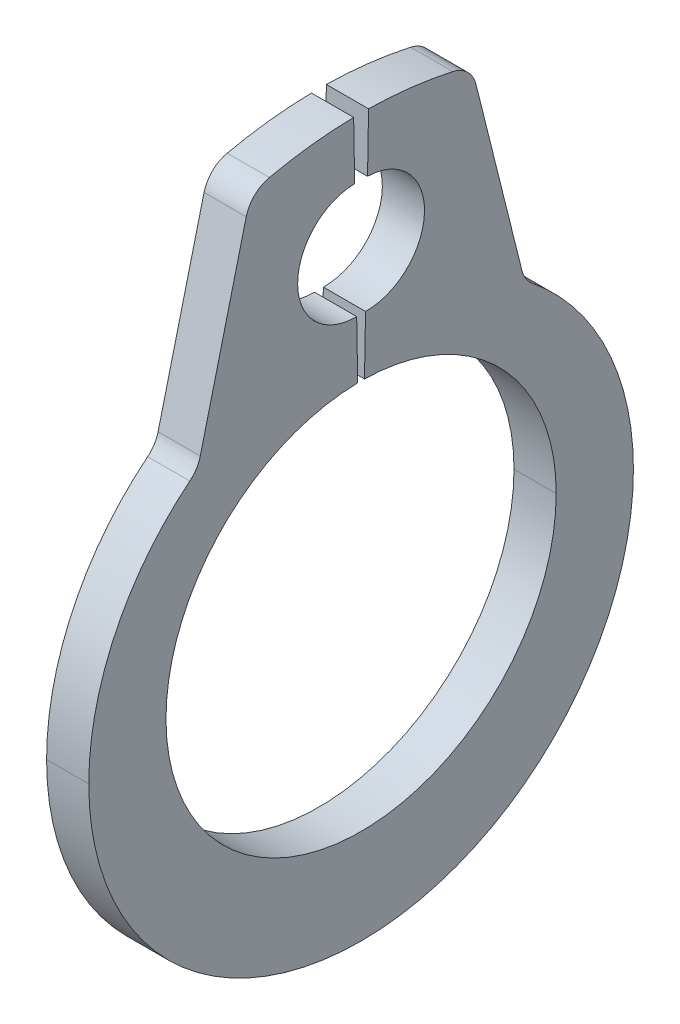
ISO-10303-21;
HEADER;
FILE_DESCRIPTION(('STEP AP214'),'2;1');
FILE_NAME('part.step','',(''),(''),'','','');
FILE_SCHEMA(('AUTOMOTIVE_DESIGN { 1 0 10303 214 1 1 1 1 }'));
ENDSEC;
DATA;
#1=APPLICATION_CONTEXT('core data for automotive mechanical design processes');
#2=APPLICATION_PROTOCOL_DEFINITION('international standard','automotive_design',2000,#1);
#3=PRODUCT_CONTEXT('',#1,'mechanical');
#4=PRODUCT('Part','Part','',(#3));
#5=PRODUCT_RELATED_PRODUCT_CATEGORY('part','',(#4));
#6=PRODUCT_DEFINITION_FORMATION('','',#4);
#7=PRODUCT_DEFINITION_CONTEXT('part definition',#1,'design');
#8=PRODUCT_DEFINITION('design','',#6,#7);
#9=PRODUCT_DEFINITION_SHAPE('','',#8);
#10=(LENGTH_UNIT() NAMED_UNIT(*) SI_UNIT(.MILLI.,.METRE.));
#11=(NAMED_UNIT(*) PLANE_ANGLE_UNIT() SI_UNIT($,.RADIAN.));
#12=(NAMED_UNIT(*) SI_UNIT($,.STERADIAN.) SOLID_ANGLE_UNIT());
#13=UNCERTAINTY_MEASURE_WITH_UNIT(LENGTH_MEASURE(1.E-05),#10,'distance_accuracy_value','');
#14=(GEOMETRIC_REPRESENTATION_CONTEXT(3) GLOBAL_UNCERTAINTY_ASSIGNED_CONTEXT((#13)) GLOBAL_UNIT_ASSIGNED_CONTEXT((#10,
#11,#12)) REPRESENTATION_CONTEXT('',''));
#15=CARTESIAN_POINT('',(0.,0.,0.));
#16=DIRECTION('',(0.,0.,1.));
#17=DIRECTION('',(1.,0.,0.));
#18=AXIS2_PLACEMENT_3D('',#15,#16,#17);
#19=CARTESIAN_POINT('',(0.2,2.06542995229727,-1.80614327960772));
#20=DIRECTION('',(-1.,0.,0.));
#21=DIRECTION('',(0.,0.,1.));
#22=AXIS2_PLACEMENT_3D('',#19,#20,#21);
#23=CYLINDRICAL_SURFACE('',#22,0.29);
#24=CARTESIAN_POINT('',(0.2,2.06542995229727,-1.80614327960772));
#25=DIRECTION('',(-1.,0.,0.));
#26=DIRECTION('',(0.,0.,-1.));
#27=AXIS2_PLACEMENT_3D('',#24,#25,#26);
#28=CIRCLE('',#27,0.29);
#29=CARTESIAN_POINT('',(0.2,1.83994430349883,-1.62378039361952));
#30=VERTEX_POINT('',#29);
#31=CARTESIAN_POINT('',(0.2,1.99527260257337,-1.52475751898768));
#32=VERTEX_POINT('',#31);
#33=EDGE_CURVE('E250',#30,#32,#28,.T.);
#34=ORIENTED_EDGE('',*,*,#33,.F.);
#35=DIRECTION('',(1.,0.,0.));
#36=VECTOR('',#35,1.);
#37=CARTESIAN_POINT('',(0.2,1.83994430349883,-1.62378039361952));
#38=LINE('',#37,#36);
#39=CARTESIAN_POINT('',(-0.2,1.83994430349883,-1.62378039361952));
#40=VERTEX_POINT('',#39);
#41=EDGE_CURVE('E265',#40,#30,#38,.T.);
#42=ORIENTED_EDGE('',*,*,#41,.F.);
#43=CARTESIAN_POINT('',(-0.2,2.06542995229727,-1.80614327960772));
#44=DIRECTION('',(1.,0.,0.));
#45=DIRECTION('',(0.,0.,-1.));
#46=AXIS2_PLACEMENT_3D('',#43,#44,#45);
#47=CIRCLE('',#46,0.29);
#48=CARTESIAN_POINT('',(-0.2,1.99527260257337,-1.52475751898768));
#49=VERTEX_POINT('',#48);
#50=EDGE_CURVE('E28',#49,#40,#47,.T.);
#51=ORIENTED_EDGE('',*,*,#50,.F.);
#52=DIRECTION('',(-1.,0.,0.));
#53=VECTOR('',#52,1.);
#54=CARTESIAN_POINT('',(-0.2,1.99527260257338,-1.52475751898768));
#55=LINE('',#54,#53);
#56=EDGE_CURVE('E227',#32,#49,#55,.T.);
#57=ORIENTED_EDGE('',*,*,#56,.F.);
#58=EDGE_LOOP('',(#34,#42,#51,#57));
#59=FACE_BOUND('',#58,.T.);
#60=ADVANCED_FACE('F17',(#59),#23,.F.);
#61=CARTESIAN_POINT('',(0.2,3.67220682023433,-0.807772907087413));
#62=DIRECTION('',(-1.,0.,0.));
#63=DIRECTION('',(0.,0.,1.));
#64=AXIS2_PLACEMENT_3D('',#61,#62,#63);
#65=CYLINDRICAL_SURFACE('',#64,0.29);
#66=CARTESIAN_POINT('',(0.2,3.67220682023433,-0.807772907087413));
#67=DIRECTION('',(1.,0.,0.));
#68=DIRECTION('',(0.,0.,-1.));
#69=AXIS2_PLACEMENT_3D('',#66,#67,#68);
#70=CIRCLE('',#69,0.29);
#71=CARTESIAN_POINT('',(0.2,3.74236416995824,-1.08915866770745));
#72=VERTEX_POINT('',#71);
#73=CARTESIAN_POINT('',(0.2,3.9554355377524,-0.87007454087873));
#74=VERTEX_POINT('',#73);
#75=EDGE_CURVE('E247',#72,#74,#70,.T.);
#76=ORIENTED_EDGE('',*,*,#75,.F.);
#77=DIRECTION('',(1.,0.,0.));
#78=VECTOR('',#77,1.);
#79=CARTESIAN_POINT('',(0.2,3.74236416995824,-1.08915866770745));
#80=LINE('',#79,#78);
#81=CARTESIAN_POINT('',(-0.2,3.74236416995824,-1.08915866770745));
#82=VERTEX_POINT('',#81);
#83=EDGE_CURVE('E335',#82,#72,#80,.T.);
#84=ORIENTED_EDGE('',*,*,#83,.F.);
#85=CARTESIAN_POINT('',(-0.2,3.67220682023433,-0.807772907087413));
#86=DIRECTION('',(-1.,0.,0.));
#87=DIRECTION('',(0.,0.,-1.));
#88=AXIS2_PLACEMENT_3D('',#85,#86,#87);
#89=CIRCLE('',#88,0.29);
#90=CARTESIAN_POINT('',(-0.2,3.9554355377524,-0.87007454087873));
#91=VERTEX_POINT('',#90);
#92=EDGE_CURVE('E309',#91,#82,#89,.T.);
#93=ORIENTED_EDGE('',*,*,#92,.F.);
#94=DIRECTION('',(-1.,0.,0.));
#95=VECTOR('',#94,1.);
#96=CARTESIAN_POINT('',(0.2,3.9554355377524,-0.87007454087873));
#97=LINE('',#96,#95);
#98=EDGE_CURVE('E256',#74,#91,#97,.T.);
#99=ORIENTED_EDGE('',*,*,#98,.F.);
#100=EDGE_LOOP('',(#76,#84,#93,#99));
#101=FACE_BOUND('',#100,.T.);
#102=ADVANCED_FACE('F801',(#101),#65,.T.);
#103=CARTESIAN_POINT('',(0.2,3.67220682023434,0.807772907087413));
#104=DIRECTION('',(-1.,0.,0.));
#105=DIRECTION('',(0.,0.,1.));
#106=AXIS2_PLACEMENT_3D('',#103,#104,#105);
#107=CYLINDRICAL_SURFACE('',#106,0.29);
#108=CARTESIAN_POINT('',(0.2,3.67220682023434,0.807772907087413));
#109=DIRECTION('',(1.,0.,0.));
#110=DIRECTION('',(0.,0.,-1.));
#111=AXIS2_PLACEMENT_3D('',#108,#109,#110);
#112=CIRCLE('',#111,0.29);
#113=CARTESIAN_POINT('',(0.2,3.9554355377524,0.870074540878729));
#114=VERTEX_POINT('',#113);
#115=CARTESIAN_POINT('',(0.2,3.74236416995824,1.08915866770745));
#116=VERTEX_POINT('',#115);
#117=EDGE_CURVE('E314',#114,#116,#112,.T.);
#118=ORIENTED_EDGE('',*,*,#117,.F.);
#119=DIRECTION('',(1.,0.,0.));
#120=VECTOR('',#119,1.);
#121=CARTESIAN_POINT('',(0.2,3.9554355377524,0.870074540878729));
#122=LINE('',#121,#120);
#123=CARTESIAN_POINT('',(-0.2,3.9554355377524,0.870074540878729));
#124=VERTEX_POINT('',#123);
#125=EDGE_CURVE('E194',#124,#114,#122,.T.);
#126=ORIENTED_EDGE('',*,*,#125,.F.);
#127=CARTESIAN_POINT('',(-0.2,3.67220682023434,0.807772907087413));
#128=DIRECTION('',(-1.,0.,0.));
#129=DIRECTION('',(0.,0.,-1.));
#130=AXIS2_PLACEMENT_3D('',#127,#128,#129);
#131=CIRCLE('',#130,0.29);
#132=CARTESIAN_POINT('',(-0.2,3.74236416995824,1.08915866770745));
#133=VERTEX_POINT('',#132);
#134=EDGE_CURVE('E189',#133,#124,#131,.T.);
#135=ORIENTED_EDGE('',*,*,#134,.F.);
#136=DIRECTION('',(-1.,0.,0.));
#137=VECTOR('',#136,1.);
#138=CARTESIAN_POINT('',(0.2,3.74236416995824,1.08915866770745));
#139=LINE('',#138,#137);
#140=EDGE_CURVE('E292',#116,#133,#139,.T.);
#141=ORIENTED_EDGE('',*,*,#140,.F.);
#142=EDGE_LOOP('',(#118,#126,#135,#141));
#143=FACE_BOUND('',#142,.T.);
#144=ADVANCED_FACE('F790',(#143),#107,.T.);
#145=CARTESIAN_POINT('',(0.2,2.06542995229728,1.80614327960772));
#146=DIRECTION('',(-1.,0.,0.));
#147=DIRECTION('',(0.,0.,1.));
#148=AXIS2_PLACEMENT_3D('',#145,#146,#147);
#149=CYLINDRICAL_SURFACE('',#148,0.29);
#150=CARTESIAN_POINT('',(0.2,2.06542995229728,1.80614327960772));
#151=DIRECTION('',(-1.,0.,0.));
#152=DIRECTION('',(0.,0.,-1.));
#153=AXIS2_PLACEMENT_3D('',#150,#151,#152);
#154=CIRCLE('',#153,0.29);
#155=CARTESIAN_POINT('',(0.2,1.99527260257338,1.52475751898767));
#156=VERTEX_POINT('',#155);
#157=CARTESIAN_POINT('',(0.2,1.83994430349883,1.62378039361951));
#158=VERTEX_POINT('',#157);
#159=EDGE_CURVE('E343',#156,#158,#154,.T.);
#160=ORIENTED_EDGE('',*,*,#159,.F.);
#161=DIRECTION('',(1.,0.,0.));
#162=VECTOR('',#161,1.);
#163=CARTESIAN_POINT('',(0.2,1.99527260257338,1.52475751898767));
#164=LINE('',#163,#162);
#165=CARTESIAN_POINT('',(-0.2,1.99527260257338,1.52475751898767));
#166=VERTEX_POINT('',#165);
#167=EDGE_CURVE('E352',#166,#156,#164,.T.);
#168=ORIENTED_EDGE('',*,*,#167,.F.);
#169=CARTESIAN_POINT('',(-0.2,2.06542995229728,1.80614327960772));
#170=DIRECTION('',(1.,0.,0.));
#171=DIRECTION('',(0.,0.,-1.));
#172=AXIS2_PLACEMENT_3D('',#169,#170,#171);
#173=CIRCLE('',#172,0.29);
#174=CARTESIAN_POINT('',(-0.2,1.83994430349883,1.62378039361951));
#175=VERTEX_POINT('',#174);
#176=EDGE_CURVE('E11',#175,#166,#173,.T.);
#177=ORIENTED_EDGE('',*,*,#176,.F.);
#178=DIRECTION('',(-1.,0.,0.));
#179=VECTOR('',#178,1.);
#180=CARTESIAN_POINT('',(0.2,1.83994430349883,1.62378039361951));
#181=LINE('',#180,#179);
#182=EDGE_CURVE('E388',#158,#175,#181,.T.);
#183=ORIENTED_EDGE('',*,*,#182,.F.);
#184=EDGE_LOOP('',(#160,#168,#177,#183));
#185=FACE_BOUND('',#184,.T.);
#186=ADVANCED_FACE('F781',(#185),#149,.F.);
#187=CARTESIAN_POINT('',(-0.2,0.,0.));
#188=DIRECTION('',(1.,0.,0.));
#189=DIRECTION('',(0.,1.,0.));
#190=AXIS2_PLACEMENT_3D('',#187,#188,#189);
#191=PLANE('',#190);
#192=DIRECTION('',(0.,-0.970295726275997,0.241921895599665));
#193=VECTOR('',#192,1.);
#194=CARTESIAN_POINT('',(-0.2,3.91238787086019,1.04676699792556));
#195=LINE('',#194,#193);
#196=EDGE_CURVE('E355',#133,#166,#195,.T.);
#197=ORIENTED_EDGE('',*,*,#196,.F.);
#198=ORIENTED_EDGE('',*,*,#134,.T.);
#199=CARTESIAN_POINT('',(-0.2,0.,0.));
#200=DIRECTION('',(1.,0.,0.));
#201=DIRECTION('',(0.,0.,-1.));
#202=AXIS2_PLACEMENT_3D('',#199,#200,#201);
#203=CIRCLE('',#202,4.05);
#204=CARTESIAN_POINT('',(-0.2,4.04938316538338,0.0706822460709984));
#205=VERTEX_POINT('',#204);
#206=EDGE_CURVE('E181',#205,#124,#203,.T.);
#207=ORIENTED_EDGE('',*,*,#206,.F.);
#208=DIRECTION('',(0.,0.999847695156391,0.0174524064372835));
#209=VECTOR('',#208,1.);
#210=CARTESIAN_POINT('',(-0.2,3.49946693304737,0.0610834225304924));
#211=LINE('',#210,#209);
#212=CARTESIAN_POINT('',(-0.2,3.49946693304737,0.0610834225304923));
#213=VERTEX_POINT('',#212);
#214=EDGE_CURVE('E187',#213,#205,#211,.T.);
#215=ORIENTED_EDGE('',*,*,#214,.F.);
#216=CARTESIAN_POINT('',(-0.2,2.94955070071135,0.0514845989899865));
#217=DIRECTION('',(-1.,0.,0.));
#218=DIRECTION('',(0.,0.,1.));
#219=AXIS2_PLACEMENT_3D('',#216,#217,#218);
#220=CIRCLE('',#219,0.55);
#221=CARTESIAN_POINT('',(-0.2,2.94955070071135,0.601484598989986));
#222=VERTEX_POINT('',#221);
#223=EDGE_CURVE('E428',#222,#213,#220,.T.);
#224=ORIENTED_EDGE('',*,*,#223,.F.);
#225=CARTESIAN_POINT('',(-0.2,2.94955070071135,0.0514845989899865));
#226=DIRECTION('',(-1.,0.,0.));
#227=DIRECTION('',(0.,0.,1.));
#228=AXIS2_PLACEMENT_3D('',#225,#226,#227);
#229=CIRCLE('',#228,0.55);
#230=CARTESIAN_POINT('',(-0.2,2.39963446837534,0.0418857754494806));
#231=VERTEX_POINT('',#230);
#232=EDGE_CURVE('E210',#231,#222,#229,.T.);
#233=ORIENTED_EDGE('',*,*,#232,.F.);
#234=DIRECTION('',(0.,0.999847695156391,0.0174524064372835));
#235=VECTOR('',#234,1.);
#236=CARTESIAN_POINT('',(-0.2,2.39963446837534,0.0418857754494806));
#237=LINE('',#236,#235);
#238=CARTESIAN_POINT('',(-0.2,1.84971823603932,0.0322869519089745));
#239=VERTEX_POINT('',#238);
#240=EDGE_CURVE('E222',#239,#231,#237,.T.);
#241=ORIENTED_EDGE('',*,*,#240,.F.);
#242=CARTESIAN_POINT('',(-0.2,0.,0.));
#243=DIRECTION('',(-1.,0.,0.));
#244=DIRECTION('',(0.,0.,-1.));
#245=AXIS2_PLACEMENT_3D('',#242,#243,#244);
#246=CIRCLE('',#245,1.85);
#247=CARTESIAN_POINT('',(-0.2,0.,1.85));
#248=VERTEX_POINT('',#247);
#249=EDGE_CURVE('E308',#248,#239,#246,.T.);
#250=ORIENTED_EDGE('',*,*,#249,.F.);
#251=CARTESIAN_POINT('',(-0.2,0.,0.));
#252=DIRECTION('',(-1.,0.,0.));
#253=DIRECTION('',(0.,0.,-1.));
#254=AXIS2_PLACEMENT_3D('',#251,#252,#253);
#255=CIRCLE('',#254,1.85);
#256=CARTESIAN_POINT('',(-0.2,0.,-1.85));
#257=VERTEX_POINT('',#256);
#258=EDGE_CURVE('E298',#257,#248,#255,.T.);
#259=ORIENTED_EDGE('',*,*,#258,.F.);
#260=CARTESIAN_POINT('',(-0.2,0.,0.));
#261=DIRECTION('',(-1.,0.,0.));
#262=DIRECTION('',(0.,0.,-1.));
#263=AXIS2_PLACEMENT_3D('',#260,#261,#262);
#264=CIRCLE('',#263,1.85);
#265=CARTESIAN_POINT('',(-0.2,1.84971823603932,-0.0322869519089745));
#266=VERTEX_POINT('',#265);
#267=EDGE_CURVE('E225',#266,#257,#264,.T.);
#268=ORIENTED_EDGE('',*,*,#267,.F.);
#269=DIRECTION('',(0.,-0.999847695156391,0.0174524064372842));
#270=VECTOR('',#269,1.);
#271=CARTESIAN_POINT('',(-0.2,1.84971823603932,-0.0322869519089745));
#272=LINE('',#271,#270);
#273=CARTESIAN_POINT('',(-0.2,2.39963446837534,-0.0418857754494812));
#274=VERTEX_POINT('',#273);
#275=EDGE_CURVE('E243',#274,#266,#272,.T.);
#276=ORIENTED_EDGE('',*,*,#275,.F.);
#277=CARTESIAN_POINT('',(-0.2,2.94955070071135,-0.0514845989899869));
#278=DIRECTION('',(-1.,0.,0.));
#279=DIRECTION('',(0.,0.,1.));
#280=AXIS2_PLACEMENT_3D('',#277,#278,#279);
#281=CIRCLE('',#280,0.55);
#282=CARTESIAN_POINT('',(-0.2,3.49946693304737,-0.0610834225304929));
#283=VERTEX_POINT('',#282);
#284=EDGE_CURVE('E239',#283,#274,#281,.T.);
#285=ORIENTED_EDGE('',*,*,#284,.F.);
#286=DIRECTION('',(0.,-0.999847695156391,0.0174524064372837));
#287=VECTOR('',#286,1.);
#288=CARTESIAN_POINT('',(-0.2,3.49946693304737,-0.0610834225304929));
#289=LINE('',#288,#287);
#290=CARTESIAN_POINT('',(-0.2,4.04938316538338,-0.0706822460709989));
#291=VERTEX_POINT('',#290);
#292=EDGE_CURVE('E238',#291,#283,#289,.T.);
#293=ORIENTED_EDGE('',*,*,#292,.F.);
#294=CARTESIAN_POINT('',(-0.2,0.,0.));
#295=DIRECTION('',(1.,0.,0.));
#296=DIRECTION('',(0.,0.,1.));
#297=AXIS2_PLACEMENT_3D('',#294,#295,#296);
#298=CIRCLE('',#297,4.05);
#299=EDGE_CURVE('E251',#91,#291,#298,.T.);
#300=ORIENTED_EDGE('',*,*,#299,.F.);
#301=ORIENTED_EDGE('',*,*,#92,.T.);
#302=DIRECTION('',(0.,0.970295726275997,0.241921895599667));
#303=VECTOR('',#302,1.);
#304=CARTESIAN_POINT('',(-0.2,3.91238787086019,-1.04676699792556));
#305=LINE('',#304,#303);
#306=EDGE_CURVE('E339',#49,#82,#305,.T.);
#307=ORIENTED_EDGE('',*,*,#306,.F.);
#308=ORIENTED_EDGE('',*,*,#50,.T.);
#309=CARTESIAN_POINT('',(-0.2,-0.167806196705348,0.));
#310=DIRECTION('',(1.,0.,0.));
#311=DIRECTION('',(0.,0.,-1.));
#312=AXIS2_PLACEMENT_3D('',#309,#310,#311);
#313=CIRCLE('',#312,2.58219380329465);
#314=CARTESIAN_POINT('',(-0.2,-0.167806196705348,-2.58219380329465));
#315=VERTEX_POINT('',#314);
#316=EDGE_CURVE('E270',#315,#40,#313,.T.);
#317=ORIENTED_EDGE('',*,*,#316,.F.);
#318=CARTESIAN_POINT('',(-0.2,-0.167806196705348,0.));
#319=DIRECTION('',(1.,0.,0.));
#320=DIRECTION('',(0.,0.,-1.));
#321=AXIS2_PLACEMENT_3D('',#318,#319,#320);
#322=CIRCLE('',#321,2.58219380329465);
#323=CARTESIAN_POINT('',(-0.2,-0.167806196705348,2.58219380329465));
#324=VERTEX_POINT('',#323);
#325=EDGE_CURVE('E282',#324,#315,#322,.T.);
#326=ORIENTED_EDGE('',*,*,#325,.F.);
#327=CARTESIAN_POINT('',(-0.2,-0.167806196705348,0.));
#328=DIRECTION('',(1.,0.,0.));
#329=DIRECTION('',(0.,0.,-1.));
#330=AXIS2_PLACEMENT_3D('',#327,#328,#329);
#331=CIRCLE('',#330,2.58219380329465);
#332=EDGE_CURVE('E391',#175,#324,#331,.T.);
#333=ORIENTED_EDGE('',*,*,#332,.F.);
#334=ORIENTED_EDGE('',*,*,#176,.T.);
#335=EDGE_LOOP('',(#197,#198,#207,#215,#224,#233,#241,#250,#259,#268,#276,#285,#293,#300,#301,
#307,#308,#317,#326,#333,#334));
#336=FACE_BOUND('',#335,.T.);
#337=ADVANCED_FACE('F184',(#336),#191,.F.);
#338=CARTESIAN_POINT('',(0.2,0.,0.));
#339=DIRECTION('',(1.,0.,0.));
#340=DIRECTION('',(0.,1.,0.));
#341=AXIS2_PLACEMENT_3D('',#338,#339,#340);
#342=PLANE('',#341);
#343=CARTESIAN_POINT('',(0.2,0.,0.));
#344=DIRECTION('',(1.,0.,0.));
#345=DIRECTION('',(0.,0.,-1.));
#346=AXIS2_PLACEMENT_3D('',#343,#344,#345);
#347=CIRCLE('',#346,4.05);
#348=CARTESIAN_POINT('',(0.2,4.04938316538338,0.0706822460709984));
#349=VERTEX_POINT('',#348);
#350=EDGE_CURVE('E200',#349,#114,#347,.T.);
#351=ORIENTED_EDGE('',*,*,#350,.T.);
#352=ORIENTED_EDGE('',*,*,#117,.T.);
#353=DIRECTION('',(0.,-0.970295726275997,0.241921895599665));
#354=VECTOR('',#353,1.);
#355=CARTESIAN_POINT('',(0.2,3.91238787086019,1.04676699792556));
#356=LINE('',#355,#354);
#357=EDGE_CURVE('E297',#116,#156,#356,.T.);
#358=ORIENTED_EDGE('',*,*,#357,.T.);
#359=ORIENTED_EDGE('',*,*,#159,.T.);
#360=CARTESIAN_POINT('',(0.2,-0.167806196705348,0.));
#361=DIRECTION('',(1.,0.,0.));
#362=DIRECTION('',(0.,0.,-1.));
#363=AXIS2_PLACEMENT_3D('',#360,#361,#362);
#364=CIRCLE('',#363,2.58219380329465);
#365=CARTESIAN_POINT('',(0.2,-0.167806196705348,2.58219380329465));
#366=VERTEX_POINT('',#365);
#367=EDGE_CURVE('E296',#158,#366,#364,.T.);
#368=ORIENTED_EDGE('',*,*,#367,.T.);
#369=CARTESIAN_POINT('',(0.2,-0.167806196705348,0.));
#370=DIRECTION('',(1.,0.,0.));
#371=DIRECTION('',(0.,0.,-1.));
#372=AXIS2_PLACEMENT_3D('',#369,#370,#371);
#373=CIRCLE('',#372,2.58219380329465);
#374=CARTESIAN_POINT('',(0.2,-0.167806196705348,-2.58219380329465));
#375=VERTEX_POINT('',#374);
#376=EDGE_CURVE('E269',#366,#375,#373,.T.);
#377=ORIENTED_EDGE('',*,*,#376,.T.);
#378=CARTESIAN_POINT('',(0.2,-0.167806196705348,0.));
#379=DIRECTION('',(1.,0.,0.));
#380=DIRECTION('',(0.,0.,-1.));
#381=AXIS2_PLACEMENT_3D('',#378,#379,#380);
#382=CIRCLE('',#381,2.58219380329465);
#383=EDGE_CURVE('E260',#375,#30,#382,.T.);
#384=ORIENTED_EDGE('',*,*,#383,.T.);
#385=ORIENTED_EDGE('',*,*,#33,.T.);
#386=DIRECTION('',(0.,0.970295726275997,0.241921895599667));
#387=VECTOR('',#386,1.);
#388=CARTESIAN_POINT('',(0.2,3.91238787086019,-1.04676699792556));
#389=LINE('',#388,#387);
#390=EDGE_CURVE('E232',#32,#72,#389,.T.);
#391=ORIENTED_EDGE('',*,*,#390,.T.);
#392=ORIENTED_EDGE('',*,*,#75,.T.);
#393=CARTESIAN_POINT('',(0.2,0.,0.));
#394=DIRECTION('',(1.,0.,0.));
#395=DIRECTION('',(0.,0.,1.));
#396=AXIS2_PLACEMENT_3D('',#393,#394,#395);
#397=CIRCLE('',#396,4.05);
#398=CARTESIAN_POINT('',(0.2,4.04938316538338,-0.0706822460709989));
#399=VERTEX_POINT('',#398);
#400=EDGE_CURVE('E231',#74,#399,#397,.T.);
#401=ORIENTED_EDGE('',*,*,#400,.T.);
#402=DIRECTION('',(0.,-0.999847695156391,0.0174524064372837));
#403=VECTOR('',#402,1.);
#404=CARTESIAN_POINT('',(0.2,3.49946693304737,-0.0610834225304929));
#405=LINE('',#404,#403);
#406=CARTESIAN_POINT('',(0.2,3.49946693304737,-0.0610834225304929));
#407=VERTEX_POINT('',#406);
#408=EDGE_CURVE('E237',#399,#407,#405,.T.);
#409=ORIENTED_EDGE('',*,*,#408,.T.);
#410=CARTESIAN_POINT('',(0.2,2.94955070071135,-0.0514845989899869));
#411=DIRECTION('',(-1.,0.,0.));
#412=DIRECTION('',(0.,0.,1.));
#413=AXIS2_PLACEMENT_3D('',#410,#411,#412);
#414=CIRCLE('',#413,0.55);
#415=CARTESIAN_POINT('',(0.2,2.39963446837534,-0.0418857754494812));
#416=VERTEX_POINT('',#415);
#417=EDGE_CURVE('E246',#407,#416,#414,.T.);
#418=ORIENTED_EDGE('',*,*,#417,.T.);
#419=DIRECTION('',(0.,-0.999847695156391,0.0174524064372842));
#420=VECTOR('',#419,1.);
#421=CARTESIAN_POINT('',(0.2,1.84971823603932,-0.0322869519089745));
#422=LINE('',#421,#420);
#423=CARTESIAN_POINT('',(0.2,1.84971823603932,-0.0322869519089745));
#424=VERTEX_POINT('',#423);
#425=EDGE_CURVE('E43',#416,#424,#422,.T.);
#426=ORIENTED_EDGE('',*,*,#425,.T.);
#427=CARTESIAN_POINT('',(0.2,0.,0.));
#428=DIRECTION('',(-1.,0.,0.));
#429=DIRECTION('',(0.,0.,-1.));
#430=AXIS2_PLACEMENT_3D('',#427,#428,#429);
#431=CIRCLE('',#430,1.85);
#432=CARTESIAN_POINT('',(0.2,0.,-1.85));
#433=VERTEX_POINT('',#432);
#434=EDGE_CURVE('E274',#424,#433,#431,.T.);
#435=ORIENTED_EDGE('',*,*,#434,.T.);
#436=CARTESIAN_POINT('',(0.2,0.,0.));
#437=DIRECTION('',(-1.,0.,0.));
#438=DIRECTION('',(0.,0.,-1.));
#439=AXIS2_PLACEMENT_3D('',#436,#437,#438);
#440=CIRCLE('',#439,1.85);
#441=CARTESIAN_POINT('',(0.2,0.,1.85));
#442=VERTEX_POINT('',#441);
#443=EDGE_CURVE('E328',#433,#442,#440,.T.);
#444=ORIENTED_EDGE('',*,*,#443,.T.);
#445=CARTESIAN_POINT('',(0.2,0.,0.));
#446=DIRECTION('',(-1.,0.,0.));
#447=DIRECTION('',(0.,0.,-1.));
#448=AXIS2_PLACEMENT_3D('',#445,#446,#447);
#449=CIRCLE('',#448,1.85);
#450=CARTESIAN_POINT('',(0.2,1.84971823603932,0.0322869519089745));
#451=VERTEX_POINT('',#450);
#452=EDGE_CURVE('E304',#442,#451,#449,.T.);
#453=ORIENTED_EDGE('',*,*,#452,.T.);
#454=DIRECTION('',(0.,0.999847695156391,0.0174524064372835));
#455=VECTOR('',#454,1.);
#456=CARTESIAN_POINT('',(0.2,2.39963446837534,0.0418857754494806));
#457=LINE('',#456,#455);
#458=CARTESIAN_POINT('',(0.2,2.39963446837534,0.0418857754494806));
#459=VERTEX_POINT('',#458);
#460=EDGE_CURVE('E329',#451,#459,#457,.T.);
#461=ORIENTED_EDGE('',*,*,#460,.T.);
#462=CARTESIAN_POINT('',(0.2,2.94955070071135,0.0514845989899865));
#463=DIRECTION('',(-1.,0.,0.));
#464=DIRECTION('',(0.,0.,1.));
#465=AXIS2_PLACEMENT_3D('',#462,#463,#464);
#466=CIRCLE('',#465,0.55);
#467=CARTESIAN_POINT('',(0.2,2.94955070071135,0.601484598989986));
#468=VERTEX_POINT('',#467);
#469=EDGE_CURVE('E216',#459,#468,#466,.T.);
#470=ORIENTED_EDGE('',*,*,#469,.T.);
#471=CARTESIAN_POINT('',(0.2,2.94955070071135,0.0514845989899865));
#472=DIRECTION('',(-1.,0.,0.));
#473=DIRECTION('',(0.,0.,1.));
#474=AXIS2_PLACEMENT_3D('',#471,#472,#473);
#475=CIRCLE('',#474,0.55);
#476=CARTESIAN_POINT('',(0.2,3.49946693304737,0.0610834225304923));
#477=VERTEX_POINT('',#476);
#478=EDGE_CURVE('E285',#468,#477,#475,.T.);
#479=ORIENTED_EDGE('',*,*,#478,.T.);
#480=DIRECTION('',(0.,0.999847695156391,0.0174524064372835));
#481=VECTOR('',#480,1.);
#482=CARTESIAN_POINT('',(0.2,3.49946693304737,0.0610834225304924));
#483=LINE('',#482,#481);
#484=EDGE_CURVE('E195',#477,#349,#483,.T.);
#485=ORIENTED_EDGE('',*,*,#484,.T.);
#486=EDGE_LOOP('',(#351,#352,#358,#359,#368,#377,#384,#385,#391,#392,#401,#409,#418,#426,#435,
#444,#453,#461,#470,#479,#485));
#487=FACE_BOUND('',#486,.T.);
#488=ADVANCED_FACE('F379',(#487),#342,.T.);
#489=CARTESIAN_POINT('',(0.2,1.84971823603932,-0.0322869519089745));
#490=DIRECTION('',(0.,-0.0174524064372842,-0.999847695156391));
#491=DIRECTION('',(0.,-0.999847695156391,0.0174524064372842));
#492=AXIS2_PLACEMENT_3D('',#489,#490,#491);
#493=PLANE('',#492);
#494=ORIENTED_EDGE('',*,*,#275,.T.);
#495=DIRECTION('',(-1.,0.,0.));
#496=VECTOR('',#495,1.);
#497=CARTESIAN_POINT('',(0.2,1.84971823603932,-0.0322869519089745));
#498=LINE('',#497,#496);
#499=EDGE_CURVE('E271',#424,#266,#498,.T.);
#500=ORIENTED_EDGE('',*,*,#499,.F.);
#501=ORIENTED_EDGE('',*,*,#425,.F.);
#502=DIRECTION('',(-1.,0.,0.));
#503=VECTOR('',#502,1.);
#504=CARTESIAN_POINT('',(0.2,2.39963446837534,-0.0418857754494812));
#505=LINE('',#504,#503);
#506=EDGE_CURVE('E21',#416,#274,#505,.T.);
#507=ORIENTED_EDGE('',*,*,#506,.T.);
#508=EDGE_LOOP('',(#494,#500,#501,#507));
#509=FACE_BOUND('',#508,.T.);
#510=ADVANCED_FACE('F752',(#509),#493,.F.);
#511=CARTESIAN_POINT('',(0.2,2.94955070071135,-0.0514845989899869));
#512=DIRECTION('',(-1.,0.,0.));
#513=DIRECTION('',(0.,0.,1.));
#514=AXIS2_PLACEMENT_3D('',#511,#512,#513);
#515=CYLINDRICAL_SURFACE('',#514,0.55);
#516=ORIENTED_EDGE('',*,*,#284,.T.);
#517=ORIENTED_EDGE('',*,*,#506,.F.);
#518=ORIENTED_EDGE('',*,*,#417,.F.);
#519=DIRECTION('',(-1.,0.,0.));
#520=VECTOR('',#519,1.);
#521=CARTESIAN_POINT('',(0.2,3.49946693304737,-0.0610834225304929));
#522=LINE('',#521,#520);
#523=EDGE_CURVE('E233',#407,#283,#522,.T.);
#524=ORIENTED_EDGE('',*,*,#523,.T.);
#525=EDGE_LOOP('',(#516,#517,#518,#524));
#526=FACE_BOUND('',#525,.T.);
#527=ADVANCED_FACE('F741',(#526),#515,.F.);
#528=CARTESIAN_POINT('',(0.2,3.49946693304737,-0.0610834225304929));
#529=DIRECTION('',(0.,-0.0174524064372837,-0.999847695156391));
#530=DIRECTION('',(0.,-0.999847695156391,0.0174524064372837));
#531=AXIS2_PLACEMENT_3D('',#528,#529,#530);
#532=PLANE('',#531);
#533=ORIENTED_EDGE('',*,*,#292,.T.);
#534=ORIENTED_EDGE('',*,*,#523,.F.);
#535=ORIENTED_EDGE('',*,*,#408,.F.);
#536=DIRECTION('',(-1.,0.,0.));
#537=VECTOR('',#536,1.);
#538=CARTESIAN_POINT('',(0.2,4.04938316538338,-0.0706822460709989));
#539=LINE('',#538,#537);
#540=EDGE_CURVE('E255',#399,#291,#539,.T.);
#541=ORIENTED_EDGE('',*,*,#540,.T.);
#542=EDGE_LOOP('',(#533,#534,#535,#541));
#543=FACE_BOUND('',#542,.T.);
#544=ADVANCED_FACE('F730',(#543),#532,.F.);
#545=CARTESIAN_POINT('',(0.2,0.,0.));
#546=DIRECTION('',(-1.,0.,0.));
#547=DIRECTION('',(0.,0.,1.));
#548=AXIS2_PLACEMENT_3D('',#545,#546,#547);
#549=CYLINDRICAL_SURFACE('',#548,4.05);
#550=ORIENTED_EDGE('',*,*,#400,.F.);
#551=ORIENTED_EDGE('',*,*,#98,.T.);
#552=ORIENTED_EDGE('',*,*,#299,.T.);
#553=ORIENTED_EDGE('',*,*,#540,.F.);
#554=EDGE_LOOP('',(#550,#551,#552,#553));
#555=FACE_BOUND('',#554,.T.);
#556=ADVANCED_FACE('F718',(#555),#549,.T.);
#557=CARTESIAN_POINT('',(0.2,3.91238787086019,-1.04676699792556));
#558=DIRECTION('',(0.,-0.241921895599667,0.970295726275997));
#559=DIRECTION('',(-1.,0.,0.));
#560=AXIS2_PLACEMENT_3D('',#557,#558,#559);
#561=PLANE('',#560);
#562=ORIENTED_EDGE('',*,*,#306,.T.);
#563=ORIENTED_EDGE('',*,*,#83,.T.);
#564=ORIENTED_EDGE('',*,*,#390,.F.);
#565=ORIENTED_EDGE('',*,*,#56,.T.);
#566=EDGE_LOOP('',(#562,#563,#564,#565));
#567=FACE_BOUND('',#566,.T.);
#568=ADVANCED_FACE('F708',(#567),#561,.F.);
#569=CARTESIAN_POINT('',(0.2,-0.167806196705348,0.));
#570=DIRECTION('',(-1.,0.,0.));
#571=DIRECTION('',(0.,0.,1.));
#572=AXIS2_PLACEMENT_3D('',#569,#570,#571);
#573=CYLINDRICAL_SURFACE('',#572,2.58219380329465);
#574=DIRECTION('',(-1.,0.,0.));
#575=VECTOR('',#574,1.);
#576=CARTESIAN_POINT('',(0.2,-0.167806196705348,2.58219380329465));
#577=LINE('',#576,#575);
#578=EDGE_CURVE('E286',#366,#324,#577,.T.);
#579=ORIENTED_EDGE('',*,*,#578,.F.);
#580=ORIENTED_EDGE('',*,*,#367,.F.);
#581=ORIENTED_EDGE('',*,*,#182,.T.);
#582=ORIENTED_EDGE('',*,*,#332,.T.);
#583=EDGE_LOOP('',(#579,#580,#581,#582));
#584=FACE_BOUND('',#583,.T.);
#585=ADVANCED_FACE('F390',(#584),#573,.T.);
#586=CARTESIAN_POINT('',(0.2,3.91238787086019,1.04676699792556));
#587=DIRECTION('',(0.,-0.241921895599665,-0.970295726275997));
#588=DIRECTION('',(0.,-0.970295726275997,0.241921895599665));
#589=AXIS2_PLACEMENT_3D('',#586,#587,#588);
#590=PLANE('',#589);
#591=ORIENTED_EDGE('',*,*,#196,.T.);
#592=ORIENTED_EDGE('',*,*,#167,.T.);
#593=ORIENTED_EDGE('',*,*,#357,.F.);
#594=ORIENTED_EDGE('',*,*,#140,.T.);
#595=EDGE_LOOP('',(#591,#592,#593,#594));
#596=FACE_BOUND('',#595,.T.);
#597=ADVANCED_FACE('F685',(#596),#590,.F.);
#598=CARTESIAN_POINT('',(0.2,0.,0.));
#599=DIRECTION('',(-1.,0.,0.));
#600=DIRECTION('',(0.,0.,1.));
#601=AXIS2_PLACEMENT_3D('',#598,#599,#600);
#602=CYLINDRICAL_SURFACE('',#601,4.05);
#603=ORIENTED_EDGE('',*,*,#206,.T.);
#604=ORIENTED_EDGE('',*,*,#125,.T.);
#605=ORIENTED_EDGE('',*,*,#350,.F.);
#606=DIRECTION('',(-1.,0.,0.));
#607=VECTOR('',#606,1.);
#608=CARTESIAN_POINT('',(0.2,4.04938316538338,0.0706822460709984));
#609=LINE('',#608,#607);
#610=EDGE_CURVE('E198',#349,#205,#609,.T.);
#611=ORIENTED_EDGE('',*,*,#610,.T.);
#612=EDGE_LOOP('',(#603,#604,#605,#611));
#613=FACE_BOUND('',#612,.T.);
#614=ADVANCED_FACE('F19',(#613),#602,.T.);
#615=CARTESIAN_POINT('',(0.2,3.49946693304737,0.0610834225304924));
#616=DIRECTION('',(0.,-0.0174524064372835,0.999847695156391));
#617=DIRECTION('',(-1.,0.,0.));
#618=AXIS2_PLACEMENT_3D('',#615,#616,#617);
#619=PLANE('',#618);
#620=ORIENTED_EDGE('',*,*,#214,.T.);
#621=ORIENTED_EDGE('',*,*,#610,.F.);
#622=ORIENTED_EDGE('',*,*,#484,.F.);
#623=DIRECTION('',(-1.,0.,0.));
#624=VECTOR('',#623,1.);
#625=CARTESIAN_POINT('',(0.2,3.49946693304737,0.0610834225304923));
#626=LINE('',#625,#624);
#627=EDGE_CURVE('E207',#477,#213,#626,.T.);
#628=ORIENTED_EDGE('',*,*,#627,.T.);
#629=EDGE_LOOP('',(#620,#621,#622,#628));
#630=FACE_BOUND('',#629,.T.);
#631=ADVANCED_FACE('F205',(#630),#619,.F.);
#632=CARTESIAN_POINT('',(0.2,2.94955070071135,0.0514845989899865));
#633=DIRECTION('',(-1.,0.,0.));
#634=DIRECTION('',(0.,0.,1.));
#635=AXIS2_PLACEMENT_3D('',#632,#633,#634);
#636=CYLINDRICAL_SURFACE('',#635,0.55);
#637=DIRECTION('',(-1.,0.,0.));
#638=VECTOR('',#637,1.);
#639=CARTESIAN_POINT('',(0.2,2.94955070071135,0.601484598989986));
#640=LINE('',#639,#638);
#641=EDGE_CURVE('E324',#468,#222,#640,.T.);
#642=ORIENTED_EDGE('',*,*,#641,.F.);
#643=ORIENTED_EDGE('',*,*,#469,.F.);
#644=DIRECTION('',(-1.,0.,0.));
#645=VECTOR('',#644,1.);
#646=CARTESIAN_POINT('',(0.2,2.39963446837534,0.0418857754494806));
#647=LINE('',#646,#645);
#648=EDGE_CURVE('E220',#459,#231,#647,.T.);
#649=ORIENTED_EDGE('',*,*,#648,.T.);
#650=ORIENTED_EDGE('',*,*,#232,.T.);
#651=EDGE_LOOP('',(#642,#643,#649,#650));
#652=FACE_BOUND('',#651,.T.);
#653=ADVANCED_FACE('F652',(#652),#636,.F.);
#654=CARTESIAN_POINT('',(0.2,2.39963446837534,0.0418857754494806));
#655=DIRECTION('',(0.,-0.0174524064372835,0.999847695156391));
#656=DIRECTION('',(-1.,0.,0.));
#657=AXIS2_PLACEMENT_3D('',#654,#655,#656);
#658=PLANE('',#657);
#659=ORIENTED_EDGE('',*,*,#240,.T.);
#660=ORIENTED_EDGE('',*,*,#648,.F.);
#661=ORIENTED_EDGE('',*,*,#460,.F.);
#662=DIRECTION('',(-1.,0.,0.));
#663=VECTOR('',#662,1.);
#664=CARTESIAN_POINT('',(0.2,1.84971823603932,0.0322869519089745));
#665=LINE('',#664,#663);
#666=EDGE_CURVE('E406',#451,#239,#665,.T.);
#667=ORIENTED_EDGE('',*,*,#666,.T.);
#668=EDGE_LOOP('',(#659,#660,#661,#667));
#669=FACE_BOUND('',#668,.T.);
#670=ADVANCED_FACE('F640',(#669),#658,.F.);
#671=CARTESIAN_POINT('',(0.2,0.,0.));
#672=DIRECTION('',(-1.,0.,0.));
#673=DIRECTION('',(0.,0.,1.));
#674=AXIS2_PLACEMENT_3D('',#671,#672,#673);
#675=CYLINDRICAL_SURFACE('',#674,1.85);
#676=DIRECTION('',(-1.,0.,0.));
#677=VECTOR('',#676,1.);
#678=CARTESIAN_POINT('',(0.2,0.,-1.85));
#679=LINE('',#678,#677);
#680=EDGE_CURVE('E303',#433,#257,#679,.T.);
#681=ORIENTED_EDGE('',*,*,#680,.F.);
#682=ORIENTED_EDGE('',*,*,#434,.F.);
#683=ORIENTED_EDGE('',*,*,#499,.T.);
#684=ORIENTED_EDGE('',*,*,#267,.T.);
#685=EDGE_LOOP('',(#681,#682,#683,#684));
#686=FACE_BOUND('',#685,.T.);
#687=ADVANCED_FACE('F628',(#686),#675,.F.);
#688=CARTESIAN_POINT('',(0.2,0.,0.));
#689=DIRECTION('',(-1.,0.,0.));
#690=DIRECTION('',(0.,0.,1.));
#691=AXIS2_PLACEMENT_3D('',#688,#689,#690);
#692=CYLINDRICAL_SURFACE('',#691,1.85);
#693=ORIENTED_EDGE('',*,*,#452,.F.);
#694=DIRECTION('',(-1.,0.,0.));
#695=VECTOR('',#694,1.);
#696=CARTESIAN_POINT('',(0.2,0.,1.85));
#697=LINE('',#696,#695);
#698=EDGE_CURVE('E302',#442,#248,#697,.T.);
#699=ORIENTED_EDGE('',*,*,#698,.T.);
#700=ORIENTED_EDGE('',*,*,#249,.T.);
#701=ORIENTED_EDGE('',*,*,#666,.F.);
#702=EDGE_LOOP('',(#693,#699,#700,#701));
#703=FACE_BOUND('',#702,.T.);
#704=ADVANCED_FACE('F615',(#703),#692,.F.);
#705=CARTESIAN_POINT('',(0.2,0.,0.));
#706=DIRECTION('',(-1.,0.,0.));
#707=DIRECTION('',(0.,0.,1.));
#708=AXIS2_PLACEMENT_3D('',#705,#706,#707);
#709=CYLINDRICAL_SURFACE('',#708,1.85);
#710=ORIENTED_EDGE('',*,*,#443,.F.);
#711=ORIENTED_EDGE('',*,*,#680,.T.);
#712=ORIENTED_EDGE('',*,*,#258,.T.);
#713=ORIENTED_EDGE('',*,*,#698,.F.);
#714=EDGE_LOOP('',(#710,#711,#712,#713));
#715=FACE_BOUND('',#714,.T.);
#716=ADVANCED_FACE('F601',(#715),#709,.F.);
#717=CARTESIAN_POINT('',(0.2,2.94955070071135,0.0514845989899865));
#718=DIRECTION('',(-1.,0.,0.));
#719=DIRECTION('',(0.,0.,1.));
#720=AXIS2_PLACEMENT_3D('',#717,#718,#719);
#721=CYLINDRICAL_SURFACE('',#720,0.55);
#722=ORIENTED_EDGE('',*,*,#478,.F.);
#723=ORIENTED_EDGE('',*,*,#641,.T.);
#724=ORIENTED_EDGE('',*,*,#223,.T.);
#725=ORIENTED_EDGE('',*,*,#627,.F.);
#726=EDGE_LOOP('',(#722,#723,#724,#725));
#727=FACE_BOUND('',#726,.T.);
#728=ADVANCED_FACE('F589',(#727),#721,.F.);
#729=CARTESIAN_POINT('',(0.2,-0.167806196705348,0.));
#730=DIRECTION('',(-1.,0.,0.));
#731=DIRECTION('',(0.,0.,1.));
#732=AXIS2_PLACEMENT_3D('',#729,#730,#731);
#733=CYLINDRICAL_SURFACE('',#732,2.58219380329465);
#734=DIRECTION('',(-1.,0.,0.));
#735=VECTOR('',#734,1.);
#736=CARTESIAN_POINT('',(0.2,-0.167806196705348,-2.58219380329465));
#737=LINE('',#736,#735);
#738=EDGE_CURVE('E264',#375,#315,#737,.T.);
#739=ORIENTED_EDGE('',*,*,#738,.F.);
#740=ORIENTED_EDGE('',*,*,#376,.F.);
#741=ORIENTED_EDGE('',*,*,#578,.T.);
#742=ORIENTED_EDGE('',*,*,#325,.T.);
#743=EDGE_LOOP('',(#739,#740,#741,#742));
#744=FACE_BOUND('',#743,.T.);
#745=ADVANCED_FACE('F367',(#744),#733,.T.);
#746=CARTESIAN_POINT('',(0.2,-0.167806196705348,0.));
#747=DIRECTION('',(-1.,0.,0.));
#748=DIRECTION('',(0.,0.,1.));
#749=AXIS2_PLACEMENT_3D('',#746,#747,#748);
#750=CYLINDRICAL_SURFACE('',#749,2.58219380329465);
#751=ORIENTED_EDGE('',*,*,#383,.F.);
#752=ORIENTED_EDGE('',*,*,#738,.T.);
#753=ORIENTED_EDGE('',*,*,#316,.T.);
#754=ORIENTED_EDGE('',*,*,#41,.T.);
#755=EDGE_LOOP('',(#751,#752,#753,#754));
#756=FACE_BOUND('',#755,.T.);
#757=ADVANCED_FACE('F363',(#756),#750,.T.);
#758=CLOSED_SHELL('',(#60,#102,#144,#186,#337,#488,#510,#527,#544,#556,#568,#585,#597,#614,#631,
#653,#670,#687,#704,#716,#728,#745,#757));
#759=MANIFOLD_SOLID_BREP('B1',#758);
#760=ADVANCED_BREP_SHAPE_REPRESENTATION('',(#18,#759),#14);
#761=SHAPE_DEFINITION_REPRESENTATION(#9,#760);
ENDSEC;
END-ISO-10303-21;
